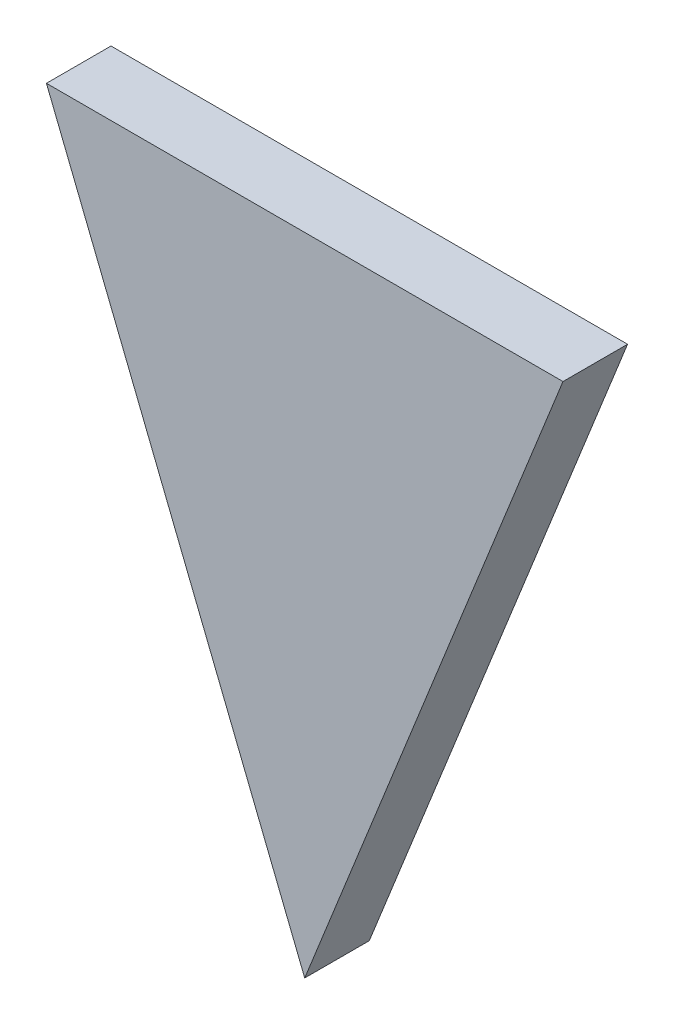
ISO-10303-21;
HEADER;
FILE_DESCRIPTION(('STEP AP214'),'2;1');
FILE_NAME('part.step','',(''),(''),'','','');
FILE_SCHEMA(('AUTOMOTIVE_DESIGN { 1 0 10303 214 1 1 1 1 }'));
ENDSEC;
DATA;
#1=APPLICATION_CONTEXT('core data for automotive mechanical design processes');
#2=APPLICATION_PROTOCOL_DEFINITION('international standard','automotive_design',2000,#1);
#3=PRODUCT_CONTEXT('',#1,'mechanical');
#4=PRODUCT('Part','Part','',(#3));
#5=PRODUCT_RELATED_PRODUCT_CATEGORY('part','',(#4));
#6=PRODUCT_DEFINITION_FORMATION('','',#4);
#7=PRODUCT_DEFINITION_CONTEXT('part definition',#1,'design');
#8=PRODUCT_DEFINITION('design','',#6,#7);
#9=PRODUCT_DEFINITION_SHAPE('','',#8);
#10=(LENGTH_UNIT() NAMED_UNIT(*) SI_UNIT(.MILLI.,.METRE.));
#11=(NAMED_UNIT(*) PLANE_ANGLE_UNIT() SI_UNIT($,.RADIAN.));
#12=(NAMED_UNIT(*) SI_UNIT($,.STERADIAN.) SOLID_ANGLE_UNIT());
#13=UNCERTAINTY_MEASURE_WITH_UNIT(LENGTH_MEASURE(1.E-05),#10,'distance_accuracy_value','');
#14=(GEOMETRIC_REPRESENTATION_CONTEXT(3) GLOBAL_UNCERTAINTY_ASSIGNED_CONTEXT((#13)) GLOBAL_UNIT_ASSIGNED_CONTEXT((#10,
#11,#12)) REPRESENTATION_CONTEXT('',''));
#15=CARTESIAN_POINT('',(0.,0.,0.));
#16=DIRECTION('',(0.,0.,1.));
#17=DIRECTION('',(1.,0.,0.));
#18=AXIS2_PLACEMENT_3D('',#15,#16,#17);
#19=CARTESIAN_POINT('',(0.,0.,0.));
#20=DIRECTION('',(0.,0.,1.));
#21=DIRECTION('',(1.,0.,0.));
#22=AXIS2_PLACEMENT_3D('',#19,#20,#21);
#23=PLANE('',#22);
#24=DIRECTION('',(-1.,0.,0.));
#25=VECTOR('',#24,1.);
#26=CARTESIAN_POINT('',(0.508,1.27,0.));
#27=LINE('',#26,#25);
#28=CARTESIAN_POINT('',(0.508,1.27,0.));
#29=VERTEX_POINT('',#28);
#30=CARTESIAN_POINT('',(-0.508,1.27,0.));
#31=VERTEX_POINT('',#30);
#32=EDGE_CURVE('E11',#29,#31,#27,.T.);
#33=ORIENTED_EDGE('',*,*,#32,.F.);
#34=DIRECTION('',(0.371390676354104,0.928476690885259,0.));
#35=VECTOR('',#34,1.);
#36=CARTESIAN_POINT('',(0.,0.,0.));
#37=LINE('',#36,#35);
#38=CARTESIAN_POINT('',(0.,0.,0.));
#39=VERTEX_POINT('',#38);
#40=EDGE_CURVE('E25',#39,#29,#37,.T.);
#41=ORIENTED_EDGE('',*,*,#40,.F.);
#42=DIRECTION('',(0.371390676354104,-0.928476690885259,0.));
#43=VECTOR('',#42,1.);
#44=CARTESIAN_POINT('',(-0.508,1.27,0.));
#45=LINE('',#44,#43);
#46=EDGE_CURVE('E82',#31,#39,#45,.T.);
#47=ORIENTED_EDGE('',*,*,#46,.F.);
#48=EDGE_LOOP('',(#33,#41,#47));
#49=FACE_BOUND('',#48,.T.);
#50=ADVANCED_FACE('F17',(#49),#23,.F.);
#51=CARTESIAN_POINT('',(-0.508,1.27,0.127));
#52=DIRECTION('',(0.928476690885259,0.371390676354104,0.));
#53=DIRECTION('',(-0.371390676354104,0.928476690885259,0.));
#54=AXIS2_PLACEMENT_3D('',#51,#52,#53);
#55=PLANE('',#54);
#56=ORIENTED_EDGE('',*,*,#46,.T.);
#57=DIRECTION('',(0.,0.,-1.));
#58=VECTOR('',#57,1.);
#59=CARTESIAN_POINT('',(0.,0.,0.127));
#60=LINE('',#59,#58);
#61=CARTESIAN_POINT('',(0.,0.,0.127));
#62=VERTEX_POINT('',#61);
#63=EDGE_CURVE('E78',#62,#39,#60,.T.);
#64=ORIENTED_EDGE('',*,*,#63,.F.);
#65=DIRECTION('',(0.371390676354104,-0.928476690885259,0.));
#66=VECTOR('',#65,1.);
#67=CARTESIAN_POINT('',(-0.508,1.27,0.127));
#68=LINE('',#67,#66);
#69=CARTESIAN_POINT('',(-0.508,1.27,0.127));
#70=VERTEX_POINT('',#69);
#71=EDGE_CURVE('E65',#70,#62,#68,.T.);
#72=ORIENTED_EDGE('',*,*,#71,.F.);
#73=DIRECTION('',(0.,0.,-1.));
#74=VECTOR('',#73,1.);
#75=CARTESIAN_POINT('',(-0.508,1.27,0.127));
#76=LINE('',#75,#74);
#77=EDGE_CURVE('E53',#70,#31,#76,.T.);
#78=ORIENTED_EDGE('',*,*,#77,.T.);
#79=EDGE_LOOP('',(#56,#64,#72,#78));
#80=FACE_BOUND('',#79,.T.);
#81=ADVANCED_FACE('F91',(#80),#55,.F.);
#82=CARTESIAN_POINT('',(0.508,1.27,0.127));
#83=DIRECTION('',(0.,-1.,0.));
#84=DIRECTION('',(0.,0.,-1.));
#85=AXIS2_PLACEMENT_3D('',#82,#83,#84);
#86=PLANE('',#85);
#87=ORIENTED_EDGE('',*,*,#32,.T.);
#88=ORIENTED_EDGE('',*,*,#77,.F.);
#89=DIRECTION('',(-1.,0.,0.));
#90=VECTOR('',#89,1.);
#91=CARTESIAN_POINT('',(0.508,1.27,0.127));
#92=LINE('',#91,#90);
#93=CARTESIAN_POINT('',(0.508,1.27,0.127));
#94=VERTEX_POINT('',#93);
#95=EDGE_CURVE('E48',#94,#70,#92,.T.);
#96=ORIENTED_EDGE('',*,*,#95,.F.);
#97=DIRECTION('',(0.,0.,-1.));
#98=VECTOR('',#97,1.);
#99=CARTESIAN_POINT('',(0.508,1.27,0.127));
#100=LINE('',#99,#98);
#101=EDGE_CURVE('E51',#94,#29,#100,.T.);
#102=ORIENTED_EDGE('',*,*,#101,.T.);
#103=EDGE_LOOP('',(#87,#88,#96,#102));
#104=FACE_BOUND('',#103,.T.);
#105=ADVANCED_FACE('F50',(#104),#86,.F.);
#106=CARTESIAN_POINT('',(0.,0.,0.127));
#107=DIRECTION('',(-0.928476690885259,0.371390676354104,0.));
#108=DIRECTION('',(-0.371390676354104,-0.928476690885259,0.));
#109=AXIS2_PLACEMENT_3D('',#106,#107,#108);
#110=PLANE('',#109);
#111=ORIENTED_EDGE('',*,*,#40,.T.);
#112=ORIENTED_EDGE('',*,*,#101,.F.);
#113=DIRECTION('',(0.371390676354104,0.928476690885259,0.));
#114=VECTOR('',#113,1.);
#115=CARTESIAN_POINT('',(0.,0.,0.127));
#116=LINE('',#115,#114);
#117=EDGE_CURVE('E62',#62,#94,#116,.T.);
#118=ORIENTED_EDGE('',*,*,#117,.F.);
#119=ORIENTED_EDGE('',*,*,#63,.T.);
#120=EDGE_LOOP('',(#111,#112,#118,#119));
#121=FACE_BOUND('',#120,.T.);
#122=ADVANCED_FACE('F60',(#121),#110,.F.);
#123=CARTESIAN_POINT('',(0.,0.,0.127));
#124=DIRECTION('',(0.,0.,1.));
#125=DIRECTION('',(1.,0.,0.));
#126=AXIS2_PLACEMENT_3D('',#123,#124,#125);
#127=PLANE('',#126);
#128=ORIENTED_EDGE('',*,*,#95,.T.);
#129=ORIENTED_EDGE('',*,*,#71,.T.);
#130=ORIENTED_EDGE('',*,*,#117,.T.);
#131=EDGE_LOOP('',(#128,#129,#130));
#132=FACE_BOUND('',#131,.T.);
#133=ADVANCED_FACE('F64',(#132),#127,.T.);
#134=CLOSED_SHELL('',(#50,#81,#105,#122,#133));
#135=MANIFOLD_SOLID_BREP('B1',#134);
#136=ADVANCED_BREP_SHAPE_REPRESENTATION('',(#18,#135),#14);
#137=SHAPE_DEFINITION_REPRESENTATION(#9,#136);
ENDSEC;
END-ISO-10303-21;
